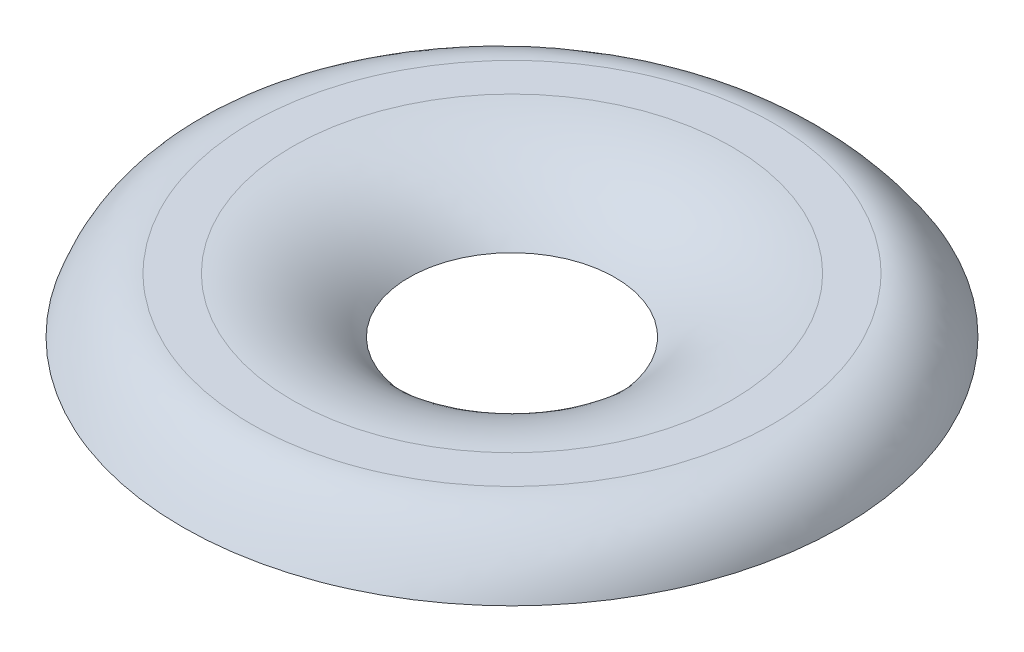
ISO-10303-21;
HEADER;
FILE_DESCRIPTION(('STEP AP214'),'2;1');
FILE_NAME('part.step','',(''),(''),'','','');
FILE_SCHEMA(('AUTOMOTIVE_DESIGN { 1 0 10303 214 1 1 1 1 }'));
ENDSEC;
DATA;
#1=APPLICATION_CONTEXT('core data for automotive mechanical design processes');
#2=APPLICATION_PROTOCOL_DEFINITION('international standard','automotive_design',2000,#1);
#3=PRODUCT_CONTEXT('',#1,'mechanical');
#4=PRODUCT('Part','Part','',(#3));
#5=PRODUCT_RELATED_PRODUCT_CATEGORY('part','',(#4));
#6=PRODUCT_DEFINITION_FORMATION('','',#4);
#7=PRODUCT_DEFINITION_CONTEXT('part definition',#1,'design');
#8=PRODUCT_DEFINITION('design','',#6,#7);
#9=PRODUCT_DEFINITION_SHAPE('','',#8);
#10=(LENGTH_UNIT() NAMED_UNIT(*) SI_UNIT(.MILLI.,.METRE.));
#11=(NAMED_UNIT(*) PLANE_ANGLE_UNIT() SI_UNIT($,.RADIAN.));
#12=(NAMED_UNIT(*) SI_UNIT($,.STERADIAN.) SOLID_ANGLE_UNIT());
#13=UNCERTAINTY_MEASURE_WITH_UNIT(LENGTH_MEASURE(1.E-05),#10,'distance_accuracy_value','');
#14=(GEOMETRIC_REPRESENTATION_CONTEXT(3) GLOBAL_UNCERTAINTY_ASSIGNED_CONTEXT((#13)) GLOBAL_UNIT_ASSIGNED_CONTEXT((#10,
#11,#12)) REPRESENTATION_CONTEXT('',''));
#15=CARTESIAN_POINT('',(0.,0.,0.));
#16=DIRECTION('',(0.,0.,1.));
#17=DIRECTION('',(1.,0.,0.));
#18=AXIS2_PLACEMENT_3D('',#15,#16,#17);
#19=CARTESIAN_POINT('',(-14.1973752245565,0.,-3.45341559516241));
#20=DIRECTION('',(0.,-1.,0.));
#21=DIRECTION('',(1.,0.,0.));
#22=AXIS2_PLACEMENT_3D('',#19,#20,#21);
#23=CYLINDRICAL_SURFACE('',#22,8.);
#24=CARTESIAN_POINT('',(-14.1973752245565,2.00000000000001,-3.45341559516241));
#25=DIRECTION('',(0.,-1.,0.));
#26=DIRECTION('',(1.,0.,0.));
#27=AXIS2_PLACEMENT_3D('',#24,#25,#26);
#28=CIRCLE('',#27,8.);
#29=CARTESIAN_POINT('',(-6.19737522455655,2.00000000000001,-3.45341559516241));
#30=VERTEX_POINT('',#29);
#31=EDGE_CURVE('E13',#30,#30,#28,.T.);
#32=ORIENTED_EDGE('',*,*,#31,.T.);
#33=EDGE_LOOP('',(#32));
#34=FACE_BOUND('',#33,.T.);
#35=CARTESIAN_POINT('',(-14.1973752245565,1.14185849984802,-3.45341559516241));
#36=DIRECTION('',(0.,-1.,0.));
#37=DIRECTION('',(1.,0.,0.));
#38=AXIS2_PLACEMENT_3D('',#35,#36,#37);
#39=CIRCLE('',#38,8.);
#40=CARTESIAN_POINT('',(-6.19737522455655,1.14185849984803,-3.45341559516241));
#41=VERTEX_POINT('',#40);
#42=EDGE_CURVE('E105',#41,#41,#39,.T.);
#43=ORIENTED_EDGE('',*,*,#42,.F.);
#44=EDGE_LOOP('',(#43));
#45=FACE_BOUND('',#44,.T.);
#46=ADVANCED_FACE('F98',(#34,#45),#23,.T.);
#47=CARTESIAN_POINT('',(-14.1973752245565,-3.51562499999999,-3.45341559516241));
#48=DIRECTION('',(0.,-1.,0.));
#49=DIRECTION('',(1.,0.,0.));
#50=AXIS2_PLACEMENT_3D('',#47,#48,#49);
#51=TOROIDAL_SURFACE('',#50,8.,5.515625);
#52=CARTESIAN_POINT('',(-14.1973752245565,0.,-3.45341559516241));
#53=DIRECTION('',(0.,-1.,0.));
#54=DIRECTION('',(1.,0.,0.));
#55=AXIS2_PLACEMENT_3D('',#52,#53,#54);
#56=CIRCLE('',#55,3.75);
#57=CARTESIAN_POINT('',(-10.4473752245565,0.,-3.45341559516241));
#58=VERTEX_POINT('',#57);
#59=EDGE_CURVE('E109',#58,#58,#56,.T.);
#60=ORIENTED_EDGE('',*,*,#59,.T.);
#61=EDGE_LOOP('',(#60));
#62=FACE_BOUND('',#61,.T.);
#63=ORIENTED_EDGE('',*,*,#31,.F.);
#64=EDGE_LOOP('',(#63));
#65=FACE_BOUND('',#64,.T.);
#66=ADVANCED_FACE('F100',(#62,#65),#51,.T.);
#67=CARTESIAN_POINT('',(-14.1973752245565,-6.87307543904334,-3.45341559516241));
#68=DIRECTION('',(0.,-1.,0.));
#69=DIRECTION('',(1.,0.,0.));
#70=AXIS2_PLACEMENT_3D('',#67,#68,#69);
#71=DEGENERATE_TOROIDAL_SURFACE('',#70,7.87500000635432,8.01590862243352,.T.);
#72=ORIENTED_EDGE('',*,*,#59,.F.);
#73=EDGE_LOOP('',(#72));
#74=FACE_BOUND('',#73,.T.);
#75=ORIENTED_EDGE('',*,*,#42,.T.);
#76=EDGE_LOOP('',(#75));
#77=FACE_BOUND('',#76,.T.);
#78=ADVANCED_FACE('F118',(#74,#77),#71,.F.);
#79=CLOSED_SHELL('',(#46,#66,#78));
#80=MANIFOLD_SOLID_BREP('B2',#79);
#81=CARTESIAN_POINT('',(-14.1973752245565,-8.,-3.45341559516241));
#82=DIRECTION('',(0.,1.,0.));
#83=DIRECTION('',(0.,0.,1.));
#84=AXIS2_PLACEMENT_3D('',#81,#82,#83);
#85=CYLINDRICAL_SURFACE('',#84,8.);
#86=CARTESIAN_POINT('',(-14.1973752245565,2.,-3.45341559516241));
#87=DIRECTION('',(0.,1.,0.));
#88=DIRECTION('',(0.,0.,1.));
#89=AXIS2_PLACEMENT_3D('',#86,#87,#88);
#90=CIRCLE('',#89,8.);
#91=CARTESIAN_POINT('',(-14.1973752245565,2.,4.54658440483759));
#92=VERTEX_POINT('',#91);
#93=EDGE_CURVE('E153',#92,#92,#90,.T.);
#94=ORIENTED_EDGE('',*,*,#93,.T.);
#95=EDGE_LOOP('',(#94));
#96=FACE_BOUND('',#95,.T.);
#97=CARTESIAN_POINT('',(-14.1973752245565,1.14185849984802,-3.45341559516241));
#98=DIRECTION('',(0.,-1.,0.));
#99=DIRECTION('',(1.,0.,0.));
#100=AXIS2_PLACEMENT_3D('',#97,#98,#99);
#101=CIRCLE('',#100,8.);
#102=CARTESIAN_POINT('',(-6.19737522455655,1.14185849984803,-3.45341559516241));
#103=VERTEX_POINT('',#102);
#104=EDGE_CURVE('E159',#103,#103,#101,.F.);
#105=ORIENTED_EDGE('',*,*,#104,.F.);
#106=EDGE_LOOP('',(#105));
#107=FACE_BOUND('',#106,.T.);
#108=ADVANCED_FACE('F144',(#96,#107),#85,.F.);
#109=CARTESIAN_POINT('',(-14.1973752245565,2.,-3.45341559516241));
#110=DIRECTION('',(0.,1.,0.));
#111=DIRECTION('',(0.,0.,1.));
#112=AXIS2_PLACEMENT_3D('',#109,#110,#111);
#113=PLANE('',#112);
#114=ORIENTED_EDGE('',*,*,#93,.F.);
#115=EDGE_LOOP('',(#114));
#116=FACE_BOUND('',#115,.T.);
#117=CARTESIAN_POINT('',(-14.1973752245565,2.,-3.45341559516241));
#118=DIRECTION('',(0.,1.,0.));
#119=DIRECTION('',(0.,0.,1.));
#120=AXIS2_PLACEMENT_3D('',#117,#118,#119);
#121=CIRCLE('',#120,9.5);
#122=CARTESIAN_POINT('',(-4.69737522455654,2.,-3.45341559516241));
#123=VERTEX_POINT('',#122);
#124=EDGE_CURVE('E97',#123,#123,#121,.T.);
#125=ORIENTED_EDGE('',*,*,#124,.T.);
#126=EDGE_LOOP('',(#125));
#127=FACE_BOUND('',#126,.T.);
#128=ADVANCED_FACE('F146',(#116,#127),#113,.T.);
#129=CARTESIAN_POINT('',(-2.19737522455654,0.,-3.4534155951624));
#130=CARTESIAN_POINT('',(-2.46036452677313,1.16884134318481,-3.45341559516241));
#131=CARTESIAN_POINT('',(-3.49931284779211,2.,-3.45341559516241));
#132=CARTESIAN_POINT('',(-4.69737522455654,2.,-3.45341559516241));
#133=CARTESIAN_POINT('',(-2.19737522455654,0.,-5.02421190942247));
#134=CARTESIAN_POINT('',(-2.46036452677313,1.16884134318481,-4.9151288320433));
#135=CARTESIAN_POINT('',(-3.49931284779211,2.,-4.80604575466413));
#136=CARTESIAN_POINT('',(-4.69737522455654,2.,-4.69696267728496));
#137=CARTESIAN_POINT('',(-2.82146113331438,0.,-8.16531598386542));
#138=CARTESIAN_POINT('',(-3.0767543117086,1.16884134318481,-7.8380737730917));
#139=CARTESIAN_POINT('',(-4.05950907023007,2.,-7.51083156231799));
#140=CARTESIAN_POINT('',(-5.1914332560129,2.00000000000001,-7.18358935154427));
#141=CARTESIAN_POINT('',(-5.49105051666778,0.,-12.1599369415598));
#142=CARTESIAN_POINT('',(-5.69464727942521,1.16884134318481,-11.5553212455501));
#143=CARTESIAN_POINT('',(-6.44384022727807,2.,-10.9507055495403));
#144=CARTESIAN_POINT('',(-7.30491024557696,1.99999999999999,-10.3460898535305));
#145=CARTESIAN_POINT('',(-9.48539712807634,0.,-14.8289669611996));
#146=CARTESIAN_POINT('',(-9.59873690431086,1.16884134318481,-14.0390009951812));
#147=CARTESIAN_POINT('',(-10.0030613125963,2.00000000000001,-13.2490350291628));
#148=CARTESIAN_POINT('',(-10.4670534917862,2.00000000000001,-12.4590690631444));
#149=CARTESIAN_POINT('',(-14.1973752245564,0.,-15.7662638223456));
#150=CARTESIAN_POINT('',(-14.1973752245565,1.16884134318481,-14.911202410547));
#151=CARTESIAN_POINT('',(-14.1973752245565,2.,-14.0561409987485));
#152=CARTESIAN_POINT('',(-14.1973752245565,2.,-13.2010795869499));
#153=CARTESIAN_POINT('',(-18.9093533210368,0.,-14.8289669611996));
#154=CARTESIAN_POINT('',(-18.7960135448023,1.16884134318481,-14.0390009951812));
#155=CARTESIAN_POINT('',(-18.3916891365169,2.00000000000001,-13.2490350291628));
#156=CARTESIAN_POINT('',(-17.9276969573269,2.,-12.4590690631444));
#157=CARTESIAN_POINT('',(-22.9036999324452,0.,-12.1599369415598));
#158=CARTESIAN_POINT('',(-22.7001031696878,1.16884134318481,-11.55532124555));
#159=CARTESIAN_POINT('',(-21.9509102218349,2.,-10.9507055495402));
#160=CARTESIAN_POINT('',(-21.0898402035361,2.,-10.3460898535305));
#161=CARTESIAN_POINT('',(-25.5732893157988,0.,-8.1653159838655));
#162=CARTESIAN_POINT('',(-25.3179961374046,1.16884134318481,-7.83807377309176));
#163=CARTESIAN_POINT('',(-24.3352413788831,2.00000000000001,-7.51083156231803));
#164=CARTESIAN_POINT('',(-23.2033171931002,2.,-7.18358935154429));
#165=CARTESIAN_POINT('',(-26.1973752245565,0.,-5.02421190942248));
#166=CARTESIAN_POINT('',(-25.93438592234,1.16884134318481,-4.9151288320433));
#167=CARTESIAN_POINT('',(-24.895437601321,2.00000000000001,-4.80604575466413));
#168=CARTESIAN_POINT('',(-23.6973752245565,2.,-4.69696267728496));
#169=CARTESIAN_POINT('',(-26.1973752245565,0.,-1.88261928090234));
#170=CARTESIAN_POINT('',(-25.93438592234,1.16884134318481,-1.99170235828151));
#171=CARTESIAN_POINT('',(-24.895437601321,2.00000000000001,-2.10078543566068));
#172=CARTESIAN_POINT('',(-23.6973752245565,2.,-2.20986851303985));
#173=CARTESIAN_POINT('',(-25.5732893157987,0.,1.2584847935406));
#174=CARTESIAN_POINT('',(-25.3179961374044,1.16884134318481,0.931242582766884));
#175=CARTESIAN_POINT('',(-24.3352413788829,2.00000000000001,0.604000371993169));
#176=CARTESIAN_POINT('',(-23.2033171931001,2.,0.276758161219453));
#177=CARTESIAN_POINT('',(-22.9036999324453,0.,5.25310575123506));
#178=CARTESIAN_POINT('',(-22.7001031696879,1.16884134318481,4.64849005522527));
#179=CARTESIAN_POINT('',(-21.9509102218351,2.,4.04387435921548));
#180=CARTESIAN_POINT('',(-21.0898402035362,2.,3.43925866320569));
#181=CARTESIAN_POINT('',(-18.9093533210368,0.,7.92213577087472));
#182=CARTESIAN_POINT('',(-18.7960135448022,1.16884134318481,7.13216980485632));
#183=CARTESIAN_POINT('',(-18.3916891365168,2.00000000000001,6.34220383883793));
#184=CARTESIAN_POINT('',(-17.9276969573268,2.,5.55223787281953));
#185=CARTESIAN_POINT('',(-14.1973752245565,0.,8.85943263202085));
#186=CARTESIAN_POINT('',(-14.1973752245565,1.16884134318481,8.00437122022228));
#187=CARTESIAN_POINT('',(-14.1973752245566,2.,7.1493098084237));
#188=CARTESIAN_POINT('',(-14.1973752245566,2.,6.29424839662512));
#189=CARTESIAN_POINT('',(-9.48539712807635,0.,7.92213577087476));
#190=CARTESIAN_POINT('',(-9.59873690431086,1.16884134318481,7.13216980485635));
#191=CARTESIAN_POINT('',(-10.0030613125963,2.,6.34220383883794));
#192=CARTESIAN_POINT('',(-10.4670534917862,2.,5.55223787281954));
#193=CARTESIAN_POINT('',(-5.49105051666779,0.,5.25310575123502));
#194=CARTESIAN_POINT('',(-5.69464727942522,1.16884134318481,4.64849005522524));
#195=CARTESIAN_POINT('',(-6.44384022727808,2.,4.04387435921546));
#196=CARTESIAN_POINT('',(-7.30491024557696,2.,3.43925866320569));
#197=CARTESIAN_POINT('',(-2.82146113331438,0.,1.25848479354064));
#198=CARTESIAN_POINT('',(-3.0767543117086,1.16884134318481,0.93124258276691));
#199=CARTESIAN_POINT('',(-4.05950907023008,2.,0.604000371993183));
#200=CARTESIAN_POINT('',(-5.19143325601291,2.,0.276758161219457));
#201=CARTESIAN_POINT('',(-2.19737522455654,0.,-1.88261928090234));
#202=CARTESIAN_POINT('',(-2.46036452677313,1.16884134318481,-1.99170235828151));
#203=CARTESIAN_POINT('',(-3.49931284779211,2.,-2.10078543566068));
#204=CARTESIAN_POINT('',(-4.69737522455654,2.,-2.20986851303985));
#205=CARTESIAN_POINT('',(-2.19737522455654,0.,-3.4534155951624));
#206=CARTESIAN_POINT('',(-2.46036452677313,1.16884134318481,-3.45341559516241));
#207=CARTESIAN_POINT('',(-3.49931284779211,2.,-3.45341559516241));
#208=CARTESIAN_POINT('',(-4.69737522455654,2.,-3.45341559516241));
#209=B_SPLINE_SURFACE_WITH_KNOTS('',3,3,((#129,#130,#131,#132),(#133,#134,#135,#136),(#137,#138,
#139,#140),(#141,#142,#143,#144),(#145,#146,#147,#148),(#149,#150,#151,#152),(#153,#154,#155,
#156),(#157,#158,#159,#160),(#161,#162,#163,#164),(#165,#166,#167,#168),(#169,#170,#171,#172),
(#173,#174,#175,#176),(#177,#178,#179,#180),(#181,#182,#183,#184),(#185,#186,#187,#188),(#189,
#190,#191,#192),(#193,#194,#195,#196),(#197,#198,#199,#200),(#201,#202,#203,#204),(#205,#206,
#207,#208)),.UNSPECIFIED.,.T.,.F.,.F.,(4,1,1,1,1,1,1,1,2,1,1,1,1,1,1,1,4),(4,4),(0.,0.0625,
0.125,0.1875,0.25,0.3125,0.375,0.4375,0.5,0.5625,0.625,0.6875,0.75,0.8125,0.875,0.9375,1.),(0.,
1.),.UNSPECIFIED.);
#210=CARTESIAN_POINT('',(-14.1973752245565,0.,-3.45341559516241));
#211=DIRECTION('',(0.,-1.,0.));
#212=DIRECTION('',(1.,0.,0.));
#213=AXIS2_PLACEMENT_3D('',#210,#211,#212);
#214=CIRCLE('',#213,12.0000000127086);
#215=CARTESIAN_POINT('',(-2.19737522455654,0.,-3.4534155951624));
#216=VERTEX_POINT('',#215);
#217=EDGE_CURVE('E168',#216,#216,#214,.T.);
#218=CARTESIAN_POINT('',(-2.19737522455654,0.,-3.4534155951624));
#219=CARTESIAN_POINT('',(-2.46036452677313,1.16884134318481,-3.45341559516241));
#220=CARTESIAN_POINT('',(-3.49931284779211,2.,-3.45341559516241));
#221=CARTESIAN_POINT('',(-4.69737522455654,2.,-3.45341559516241));
#222=CARTESIAN_POINT('',(-4.69756691453683,2.,-3.45341559516241));
#223=CARTESIAN_POINT('',(-4.69775860451711,2.,-3.45341559516241));
#224=CARTESIAN_POINT('',(-4.69795029449739,2.,-3.45341559516241));
#225=CARTESIAN_POINT('',(-2.19737522455654,0.,-5.02421190942247));
#226=CARTESIAN_POINT('',(-2.46036452677313,1.16884134318481,-4.9151288320433));
#227=CARTESIAN_POINT('',(-3.49931284779211,2.,-4.80604575466413));
#228=CARTESIAN_POINT('',(-4.69737522455654,2.,-4.69696267728496));
#229=CARTESIAN_POINT('',(-4.69756691453683,2.,-4.69694522399258));
#230=CARTESIAN_POINT('',(-4.69775860451711,2.,-4.6969277707002));
#231=CARTESIAN_POINT('',(-4.69795029449739,2.,-4.69691031740782));
#232=CARTESIAN_POINT('',(-2.82146113331438,0.,-8.16531598386542));
#233=CARTESIAN_POINT('',(-3.0767543117086,1.16884134318481,-7.8380737730917));
#234=CARTESIAN_POINT('',(-4.05950907023007,2.,-7.51083156231799));
#235=CARTESIAN_POINT('',(-5.1914332560129,2.00000000000001,-7.18358935154427));
#236=CARTESIAN_POINT('',(-5.19161436388263,2.00000000000001,-7.18353699279055));
#237=CARTESIAN_POINT('',(-5.19179547175235,2.00000000000001,-7.18348463403682));
#238=CARTESIAN_POINT('',(-5.19197657962208,2.00000000000001,-7.1834322752831));
#239=CARTESIAN_POINT('',(-5.49105051666778,0.,-12.1599369415598));
#240=CARTESIAN_POINT('',(-5.69464727942521,1.16884134318481,-11.5553212455501));
#241=CARTESIAN_POINT('',(-6.44384022727807,2.,-10.9507055495403));
#242=CARTESIAN_POINT('',(-7.30491024557696,1.99999999999999,-10.3460898535305));
#243=CARTESIAN_POINT('',(-7.30504801677988,1.99999999999999,-10.3459931150191));
#244=CARTESIAN_POINT('',(-7.30518578798281,1.99999999999999,-10.3458963765078));
#245=CARTESIAN_POINT('',(-7.30532355918574,1.99999999999999,-10.3457996379964));
#246=CARTESIAN_POINT('',(-9.48539712807634,0.,-14.8289669611996));
#247=CARTESIAN_POINT('',(-9.59873690431086,1.16884134318481,-14.0390009951812));
#248=CARTESIAN_POINT('',(-10.0030613125963,2.00000000000001,-13.2490350291628));
#249=CARTESIAN_POINT('',(-10.4670534917862,2.00000000000001,-12.4590690631444));
#250=CARTESIAN_POINT('',(-10.4671277305349,2.00000000000001,-12.4589426685898));
#251=CARTESIAN_POINT('',(-10.4672019692836,2.00000000000001,-12.4588162740352));
#252=CARTESIAN_POINT('',(-10.4672762080322,2.00000000000001,-12.4586898794807));
#253=CARTESIAN_POINT('',(-14.1973752245564,0.,-15.7662638223456));
#254=CARTESIAN_POINT('',(-14.1973752245565,1.16884134318481,-14.911202410547));
#255=CARTESIAN_POINT('',(-14.1973752245565,2.,-14.0561409987485));
#256=CARTESIAN_POINT('',(-14.1973752245565,2.,-13.2010795869499));
#257=CARTESIAN_POINT('',(-14.1973752245565,2.,-13.200942777124));
#258=CARTESIAN_POINT('',(-14.1973752245565,2.,-13.2008059672981));
#259=CARTESIAN_POINT('',(-14.1973752245565,2.,-13.2006691574722));
#260=CARTESIAN_POINT('',(-18.9093533210368,0.,-14.8289669611996));
#261=CARTESIAN_POINT('',(-18.7960135448023,1.16884134318481,-14.0390009951812));
#262=CARTESIAN_POINT('',(-18.3916891365169,2.00000000000001,-13.2490350291628));
#263=CARTESIAN_POINT('',(-17.9276969573269,2.,-12.4590690631444));
#264=CARTESIAN_POINT('',(-17.9276227185782,2.,-12.4589426685898));
#265=CARTESIAN_POINT('',(-17.9275484798296,2.,-12.4588162740353));
#266=CARTESIAN_POINT('',(-17.9274742410809,2.,-12.4586898794807));
#267=CARTESIAN_POINT('',(-22.9036999324452,0.,-12.1599369415598));
#268=CARTESIAN_POINT('',(-22.7001031696878,1.16884134318481,-11.55532124555));
#269=CARTESIAN_POINT('',(-21.9509102218349,2.,-10.9507055495402));
#270=CARTESIAN_POINT('',(-21.0898402035361,2.,-10.3460898535305));
#271=CARTESIAN_POINT('',(-21.0897024323331,2.,-10.3459931150191));
#272=CARTESIAN_POINT('',(-21.0895646611302,2.,-10.3458963765077));
#273=CARTESIAN_POINT('',(-21.0894268899273,2.,-10.3457996379964));
#274=CARTESIAN_POINT('',(-25.5732893157988,0.,-8.1653159838655));
#275=CARTESIAN_POINT('',(-25.3179961374046,1.16884134318481,-7.83807377309176));
#276=CARTESIAN_POINT('',(-24.3352413788831,2.00000000000001,-7.51083156231803));
#277=CARTESIAN_POINT('',(-23.2033171931002,2.,-7.18358935154429));
#278=CARTESIAN_POINT('',(-23.2031360852305,2.,-7.18353699279057));
#279=CARTESIAN_POINT('',(-23.2029549773608,2.,-7.18348463403684));
#280=CARTESIAN_POINT('',(-23.2027738694911,2.,-7.18343227528312));
#281=CARTESIAN_POINT('',(-26.1973752245565,0.,-5.02421190942248));
#282=CARTESIAN_POINT('',(-25.93438592234,1.16884134318481,-4.9151288320433));
#283=CARTESIAN_POINT('',(-24.895437601321,2.00000000000001,-4.80604575466413));
#284=CARTESIAN_POINT('',(-23.6973752245565,2.,-4.69696267728496));
#285=CARTESIAN_POINT('',(-23.6971835345763,2.,-4.69694522399258));
#286=CARTESIAN_POINT('',(-23.696991844596,2.,-4.6969277707002));
#287=CARTESIAN_POINT('',(-23.6968001546157,2.,-4.69691031740782));
#288=CARTESIAN_POINT('',(-26.1973752245565,0.,-1.88261928090234));
#289=CARTESIAN_POINT('',(-25.93438592234,1.16884134318481,-1.99170235828151));
#290=CARTESIAN_POINT('',(-24.895437601321,2.00000000000001,-2.10078543566068));
#291=CARTESIAN_POINT('',(-23.6973752245565,2.,-2.20986851303985));
#292=CARTESIAN_POINT('',(-23.6971835345763,2.,-2.20988596633223));
#293=CARTESIAN_POINT('',(-23.696991844596,2.,-2.20990341962461));
#294=CARTESIAN_POINT('',(-23.6968001546157,2.,-2.20992087291699));
#295=CARTESIAN_POINT('',(-25.5732893157987,0.,1.2584847935406));
#296=CARTESIAN_POINT('',(-25.3179961374044,1.16884134318481,0.931242582766884));
#297=CARTESIAN_POINT('',(-24.3352413788829,2.00000000000001,0.604000371993169));
#298=CARTESIAN_POINT('',(-23.2033171931001,2.,0.276758161219453));
#299=CARTESIAN_POINT('',(-23.2031360852303,2.,0.276705802465729));
#300=CARTESIAN_POINT('',(-23.2029549773606,2.,0.276653443712005));
#301=CARTESIAN_POINT('',(-23.2027738694909,2.,0.276601084958281));
#302=CARTESIAN_POINT('',(-22.9036999324453,0.,5.25310575123506));
#303=CARTESIAN_POINT('',(-22.7001031696879,1.16884134318481,4.64849005522527));
#304=CARTESIAN_POINT('',(-21.9509102218351,2.,4.04387435921548));
#305=CARTESIAN_POINT('',(-21.0898402035362,2.,3.43925866320569));
#306=CARTESIAN_POINT('',(-21.0897024323333,2.,3.43916192469433));
#307=CARTESIAN_POINT('',(-21.0895646611304,2.,3.43906518618297));
#308=CARTESIAN_POINT('',(-21.0894268899275,2.,3.43896844767161));
#309=CARTESIAN_POINT('',(-18.9093533210368,0.,7.92213577087472));
#310=CARTESIAN_POINT('',(-18.7960135448022,1.16884134318481,7.13216980485632));
#311=CARTESIAN_POINT('',(-18.3916891365168,2.00000000000001,6.34220383883793));
#312=CARTESIAN_POINT('',(-17.9276969573268,2.,5.55223787281953));
#313=CARTESIAN_POINT('',(-17.9276227185781,2.,5.55211147826497));
#314=CARTESIAN_POINT('',(-17.9275484798294,2.,5.5519850837104));
#315=CARTESIAN_POINT('',(-17.9274742410808,2.,5.55185868915584));
#316=CARTESIAN_POINT('',(-14.1973752245565,0.,8.85943263202085));
#317=CARTESIAN_POINT('',(-14.1973752245565,1.16884134318481,8.00437122022228));
#318=CARTESIAN_POINT('',(-14.1973752245566,2.,7.1493098084237));
#319=CARTESIAN_POINT('',(-14.1973752245566,2.,6.29424839662512));
#320=CARTESIAN_POINT('',(-14.1973752245566,2.,6.29411158679923));
#321=CARTESIAN_POINT('',(-14.1973752245566,2.,6.29397477697334));
#322=CARTESIAN_POINT('',(-14.1973752245566,2.,6.29383796714745));
#323=CARTESIAN_POINT('',(-9.48539712807635,0.,7.92213577087476));
#324=CARTESIAN_POINT('',(-9.59873690431086,1.16884134318481,7.13216980485635));
#325=CARTESIAN_POINT('',(-10.0030613125963,2.,6.34220383883794));
#326=CARTESIAN_POINT('',(-10.4670534917862,2.,5.55223787281954));
#327=CARTESIAN_POINT('',(-10.4671277305349,2.,5.55211147826497));
#328=CARTESIAN_POINT('',(-10.4672019692836,2.,5.55198508371041));
#329=CARTESIAN_POINT('',(-10.4672762080322,2.,5.55185868915585));
#330=CARTESIAN_POINT('',(-5.49105051666779,0.,5.25310575123502));
#331=CARTESIAN_POINT('',(-5.69464727942522,1.16884134318481,4.64849005522524));
#332=CARTESIAN_POINT('',(-6.44384022727808,2.,4.04387435921546));
#333=CARTESIAN_POINT('',(-7.30491024557696,2.,3.43925866320569));
#334=CARTESIAN_POINT('',(-7.30504801677989,2.,3.43916192469433));
#335=CARTESIAN_POINT('',(-7.30518578798282,2.,3.43906518618296));
#336=CARTESIAN_POINT('',(-7.30532355918575,2.,3.4389684476716));
#337=CARTESIAN_POINT('',(-2.82146113331438,0.,1.25848479354064));
#338=CARTESIAN_POINT('',(-3.0767543117086,1.16884134318481,0.93124258276691));
#339=CARTESIAN_POINT('',(-4.05950907023008,2.,0.604000371993183));
#340=CARTESIAN_POINT('',(-5.19143325601291,2.,0.276758161219457));
#341=CARTESIAN_POINT('',(-5.19161436388263,2.,0.276705802465733));
#342=CARTESIAN_POINT('',(-5.19179547175236,2.,0.276653443712009));
#343=CARTESIAN_POINT('',(-5.19197657962208,2.,0.276601084958285));
#344=CARTESIAN_POINT('',(-2.19737522455654,0.,-1.88261928090234));
#345=CARTESIAN_POINT('',(-2.46036452677313,1.16884134318481,-1.99170235828151));
#346=CARTESIAN_POINT('',(-3.49931284779211,2.,-2.10078543566068));
#347=CARTESIAN_POINT('',(-4.69737522455654,2.,-2.20986851303985));
#348=CARTESIAN_POINT('',(-4.69756691453683,2.,-2.20988596633223));
#349=CARTESIAN_POINT('',(-4.69775860451711,2.,-2.20990341962461));
#350=CARTESIAN_POINT('',(-4.69795029449739,2.,-2.20992087291699));
#351=CARTESIAN_POINT('',(-2.19737522455654,0.,-3.4534155951624));
#352=CARTESIAN_POINT('',(-2.46036452677313,1.16884134318481,-3.45341559516241));
#353=CARTESIAN_POINT('',(-3.49931284779211,2.,-3.45341559516241));
#354=CARTESIAN_POINT('',(-4.69737522455654,2.,-3.45341559516241));
#355=CARTESIAN_POINT('',(-4.69756691453683,2.,-3.45341559516241));
#356=CARTESIAN_POINT('',(-4.69775860451711,2.,-3.45341559516241));
#357=CARTESIAN_POINT('',(-4.69795029449739,2.,-3.45341559516241));
#358=B_SPLINE_SURFACE_WITH_KNOTS('',3,3,((#218,#219,#220,#221,#222,#223,#224),(#225,#226,#227,
#228,#229,#230,#231),(#232,#233,#234,#235,#236,#237,#238),(#239,#240,#241,#242,#243,#244,#245),
(#246,#247,#248,#249,#250,#251,#252),(#253,#254,#255,#256,#257,#258,#259),(#260,#261,#262,#263,
#264,#265,#266),(#267,#268,#269,#270,#271,#272,#273),(#274,#275,#276,#277,#278,#279,#280),(#281,
#282,#283,#284,#285,#286,#287),(#288,#289,#290,#291,#292,#293,#294),(#295,#296,#297,#298,#299,
#300,#301),(#302,#303,#304,#305,#306,#307,#308),(#309,#310,#311,#312,#313,#314,#315),(#316,#317,
#318,#319,#320,#321,#322),(#323,#324,#325,#326,#327,#328,#329),(#330,#331,#332,#333,#334,#335,
#336),(#337,#338,#339,#340,#341,#342,#343),(#344,#345,#346,#347,#348,#349,#350),(#351,#352,#353,
#354,#355,#356,#357)),.UNSPECIFIED.,.T.,.F.,.F.,(4,1,1,1,1,1,1,1,2,1,1,1,1,1,1,1,4),(4,3,4),(0.,
0.0625,0.125,0.1875,0.25,0.3125,0.375,0.4375,0.5,0.5625,0.625,0.6875,0.75,0.8125,0.875,0.9375,
1.),(0.,1.,1.00016),.UNSPECIFIED.);
#359=CARTESIAN_POINT('',(-2.19737522455654,0.,-3.4534155951624));
#360=CARTESIAN_POINT('',(-2.19942771139951,0.00912218118452747,-3.4534155951624));
#361=CARTESIAN_POINT('',(-2.20152959677417,0.0182332493900005,-3.4534155951624));
#362=CARTESIAN_POINT('',(-2.20582770014776,0.0364136458860446,-3.4534155951624));
#363=CARTESIAN_POINT('',(-2.20802371869977,0.0454830213296271,-3.4534155951624));
#364=CARTESIAN_POINT('',(-2.21250949882119,0.0635795607836494,-3.4534155951624));
#365=CARTESIAN_POINT('',(-2.21479906681201,0.0726067727773328,-3.4534155951624));
#366=CARTESIAN_POINT('',(-2.21947135044594,0.0906185139485831,-3.4534155951624));
#367=CARTESIAN_POINT('',(-2.2218538782989,0.0996030918388476,-3.4534155951624));
#368=CARTESIAN_POINT('',(-2.22671148794749,0.117529093512183,-3.4534155951624));
#369=CARTESIAN_POINT('',(-2.22918638764502,0.126470566639865,-3.4534155951624));
#370=CARTESIAN_POINT('',(-2.23422814695037,0.144309887596403,-3.4534155951624));
#371=CARTESIAN_POINT('',(-2.23679483005801,0.153207785307396,-3.4534155951624));
#372=CARTESIAN_POINT('',(-2.24201956235887,0.170959484332291,-3.4534155951624));
#373=CARTESIAN_POINT('',(-2.24467744055335,0.179813335974651,-3.4534155951624));
#374=CARTESIAN_POINT('',(-2.25008396927089,0.197476471854954,-3.4534155951624));
#375=CARTESIAN_POINT('',(-2.2528324541992,0.20628580677964,-3.4534155951624));
#376=CARTESIAN_POINT('',(-2.25841960273399,0.223859438304794,-3.4534155951624));
#377=CARTESIAN_POINT('',(-2.26125810605119,0.232623785865423,-3.4534155951624));
#378=CARTESIAN_POINT('',(-2.26702469781086,0.25010697182706,-3.4534155951624));
#379=CARTESIAN_POINT('',(-2.26995263117012,0.258825861379926,-3.4534155951624));
#380=CARTESIAN_POINT('',(-2.27589748956203,0.27621766057184,-3.4534155951624));
#381=CARTESIAN_POINT('',(-2.27891426461747,0.284890621475849,-3.4534155951624));
#382=CARTESIAN_POINT('',(-2.28503621305075,0.302190092693925,-3.4534155951624));
#383=CARTESIAN_POINT('',(-2.2881412414568,0.310816654310553,-3.4534155951624));
#384=CARTESIAN_POINT('',(-2.2944391033419,0.3280228563527,-3.4534155951624));
#385=CARTESIAN_POINT('',(-2.29763179675362,0.336602548045936,-3.4534155951624));
#386=CARTESIAN_POINT('',(-2.3041043955025,0.353714539712016,-3.4534155951624));
#387=CARTESIAN_POINT('',(-2.30738416557563,0.362246890848307,-3.45341559516241));
#388=CARTESIAN_POINT('',(-2.31403032460178,0.379263730940069,-3.45341559516241));
#389=CARTESIAN_POINT('',(-2.31739658299284,0.387748270888254,-3.4534155951624));
#390=CARTESIAN_POINT('',(-2.32421512571135,0.404669018209258,-3.4534155951624));
#391=CARTESIAN_POINT('',(-2.32766728407775,0.413105276340508,-3.45341559516241));
#392=CARTESIAN_POINT('',(-2.33465703390536,0.42992898969605,-3.45341559516241));
#393=CARTESIAN_POINT('',(-2.33819450390548,0.438316495383799,-3.4534155951624));
#394=CARTESIAN_POINT('',(-2.3453542842606,0.455042233580838,-3.4534155951624));
#395=CARTESIAN_POINT('',(-2.3489764775539,0.463380516200711,-3.45341559516241));
#396=CARTESIAN_POINT('',(-2.35630511185669,0.480007338047791,-3.45341559516241));
#397=CARTESIAN_POINT('',(-2.36001144010377,0.488295926977531,-3.4534155951624));
#398=CARTESIAN_POINT('',(-2.36750775177614,0.504822891284704,-3.4534155951624));
#399=CARTESIAN_POINT('',(-2.37129762663883,0.5130613159041,-3.45341559516241));
#400=CARTESIAN_POINT('',(-2.37896043910452,0.529487481482845,-3.45341559516241));
#401=CARTESIAN_POINT('',(-2.38283327224594,0.537675271173648,-3.4534155951624));
#402=CARTESIAN_POINT('',(-2.39066140893053,0.553999696836798,-3.45341559516241));
#403=CARTESIAN_POINT('',(-2.39461661201517,0.562136380982646,-3.45341559516241));
#404=CARTESIAN_POINT('',(-2.40260889634611,0.578358125544302,-3.45341559516241));
#405=CARTESIAN_POINT('',(-2.40664588103989,0.586443233530638,-3.45341559516241));
#406=CARTESIAN_POINT('',(-2.41480113644654,0.602561355806093,-3.4534155951624));
#407=CARTESIAN_POINT('',(-2.41891931441689,0.610594417020083,-3.45341559516241));
#408=CARTESIAN_POINT('',(-2.42723636433053,0.62660797582574,-3.45341559516241));
#409=CARTESIAN_POINT('',(-2.4314351472464,0.634588519656185,-3.4534155951624));
#410=CARTESIAN_POINT('',(-2.43991281510025,0.65049657380948,-3.4534155951624));
#411=CARTESIAN_POINT('',(-2.44419161463223,0.658424129646738,-3.45341559516241));
#412=CARTESIAN_POINT('',(-2.45282872386148,0.674225737966056,-3.45341559516241));
#413=CARTESIAN_POINT('',(-2.45718695168177,0.682099835201951,-3.45341559516241));
#414=CARTESIAN_POINT('',(-2.4659823257236,0.697794056506549,-3.45341559516241));
#415=CARTESIAN_POINT('',(-2.4704193935061,0.705614224534288,-3.4534155951624));
#416=CARTESIAN_POINT('',(-2.47937185579968,0.721200117644215,-3.4534155951624));
#417=CARTESIAN_POINT('',(-2.48388717522003,0.7289658858583,-3.45341559516241));
#418=CARTESIAN_POINT('',(-2.49299554920653,0.74444250959432,-3.45341559516241));
#419=CARTESIAN_POINT('',(-2.49758853194211,0.752153407390461,-3.4534155951624));
#420=CARTESIAN_POINT('',(-2.50685164106473,0.76751982057397,-3.4534155951624));
#421=CARTESIAN_POINT('',(-2.51152169879472,0.775175377348999,-3.45341559516241));
#422=CARTESIAN_POINT('',(-2.52093836649865,0.790430638801952,-3.45341559516241));
#423=CARTESIAN_POINT('',(-2.52568491090404,0.798030383953735,-3.4534155951624));
#424=CARTESIAN_POINT('',(-2.53525396063651,0.813173552498568,-3.4534155951624));
#425=CARTESIAN_POINT('',(-2.54007640340016,0.820717015425922,-3.45341559516241));
#426=CARTESIAN_POINT('',(-2.54979665861041,0.835747149885474,-3.45341559516241));
#427=CARTESIAN_POINT('',(-2.55469441141699,0.843233859988074,-3.4534155951624));
#428=CARTESIAN_POINT('',(-2.56456469555628,0.858150019185515,-3.4534155951624));
#429=CARTESIAN_POINT('',(-2.56953717009236,0.865579505863815,-3.45341559516241));
#430=CARTESIAN_POINT('',(-2.57955630661396,0.880380748622569,-3.45341559516241));
#431=CARTESIAN_POINT('',(-2.58460291456799,0.887752541277715,-3.4534155951624));
#432=CARTESIAN_POINT('',(-2.59476972692718,0.902437926421387,-3.4534155951624));
#433=CARTESIAN_POINT('',(-2.59988987998949,0.909751554455129,-3.45341559516241));
#434=CARTESIAN_POINT('',(-2.61020319164355,0.924320140807436,-3.45341559516241));
#435=CARTESIAN_POINT('',(-2.61539630150636,0.931575133622049,-3.4534155951624));
#436=CARTESIAN_POINT('',(-2.62585493591456,0.946025980006745,-3.4534155951624));
#437=CARTESIAN_POINT('',(-2.63112041427199,0.953221867004946,-3.45341559516241));
#438=CARTESIAN_POINT('',(-2.64172319489555,0.967554032245754,-3.45341559516241));
#439=CARTESIAN_POINT('',(-2.64706045344363,0.974690342830617,-3.45341559516241));
#440=CARTESIAN_POINT('',(-2.65780620374575,0.988902885751162,-3.45341559516241));
#441=CARTESIAN_POINT('',(-2.66321465418236,0.995979149326039,-3.45341559516241));
#442=CARTESIAN_POINT('',(-2.67410219762818,1.01007112874978,-3.45341559516241));
#443=CARTESIAN_POINT('',(-2.6795812516531,1.01708687471822,-3.4534155951624));
#444=CARTESIAN_POINT('',(-2.69060941170968,1.03105734946838,-3.45341559516241));
#445=CARTESIAN_POINT('',(-2.69615848102456,1.03801210723406,-3.45341559516241));
#446=CARTESIAN_POINT('',(-2.70732608116086,1.05186013613356,-3.45341559516241));
#447=CARTESIAN_POINT('',(-2.71294457746919,1.0587534351002,-3.45341559516241));
#448=CARTESIAN_POINT('',(-2.72425044115607,1.07247807697161,-3.45341559516241));
#449=CARTESIAN_POINT('',(-2.72993777616318,1.07930944654288,-3.45341559516241));
#450=CARTESIAN_POINT('',(-2.74138072687333,1.09290976020835,-3.45341559516241));
#451=CARTESIAN_POINT('',(-2.74713631228637,1.09967872978783,-3.45341559516241));
#452=CARTESIAN_POINT('',(-2.75871517349435,1.113153774069,-3.45341559516241));
#453=CARTESIAN_POINT('',(-2.76453842102227,1.1198598730601,-3.45341559516241));
#454=CARTESIAN_POINT('',(-2.77625201620443,1.13320870677809,-3.45341559516241));
#455=CARTESIAN_POINT('',(-2.78214233755793,1.13985146458394,-3.45341559516241));
#456=CARTESIAN_POINT('',(-2.79398949019241,1.15307314655926,-3.4534155951624));
#457=CARTESIAN_POINT('',(-2.79994629708396,1.15965209258269,-3.45341559516241));
#458=CARTESIAN_POINT('',(-2.81192583065066,1.17274568163519,-3.45341559516241));
#459=CARTESIAN_POINT('',(-2.81794853479444,1.17926034527863,-3.45341559516241));
#460=CARTESIAN_POINT('',(-2.83005927277497,1.19222490022745,-3.45341559516241));
#461=CARTESIAN_POINT('',(-2.83614728588684,1.19867481089287,-3.45341559516241));
#462=CARTESIAN_POINT('',(-2.84838805176451,1.21150939055637,-3.45341559516241));
#463=CARTESIAN_POINT('',(-2.854540785562,1.21789407764522,-3.45341559516241));
#464=CARTESIAN_POINT('',(-2.8669104028218,1.23059774084095,-3.45341559516241));
#465=CARTESIAN_POINT('',(-2.87312726902404,1.23691673375409,-3.45341559516241));
#466=CARTESIAN_POINT('',(-2.88562456115257,1.24948853929872,-3.45341559516241));
#467=CARTESIAN_POINT('',(-2.8919049714803,1.25574136743635,-3.45341559516241));
#468=CARTESIAN_POINT('',(-2.90452876196576,1.26818037414564,-3.45341559516241));
#469=CARTESIAN_POINT('',(-2.91087212814125,1.27436656690726,-3.45341559516241));
#470=CARTESIAN_POINT('',(-2.92362124047341,1.28667183359596,-3.45341559516241));
#471=CARTESIAN_POINT('',(-2.93002697422044,1.29279092038029,-3.45341559516241));
#472=CARTESIAN_POINT('',(-2.94290023189058,1.30496150586216,-3.45341559516241));
#473=CARTESIAN_POINT('',(-2.94936774493441,1.31101301606709,-3.45341559516241));
#474=CARTESIAN_POINT('',(-2.96236397143532,1.3230479791548,-3.45341559516241));
#475=CARTESIAN_POINT('',(-2.96889267550262,1.32903144217735,-3.45341559516241));
#476=CARTESIAN_POINT('',(-2.98201069432851,1.34092984168247,-3.45341559516241));
#477=CARTESIAN_POINT('',(-2.98860000114733,1.34684478691867,-3.45341559516241));
#478=CARTESIAN_POINT('',(-3.00183863579386,1.35860568165161,-3.45341559516241));
#479=CARTESIAN_POINT('',(-3.00848795709359,1.36445163849654,-3.45341559516241));
#480=CARTESIAN_POINT('',(-3.02184603105775,1.3760740872665,-3.45341559516241));
#481=CARTESIAN_POINT('',(-3.02855477856908,1.38185058511417,-3.45341559516241));
#482=CARTESIAN_POINT('',(-3.04203111534921,1.39333364672911,-3.45341559516241));
#483=CARTESIAN_POINT('',(-3.04879870080404,1.39904021497241,-3.45341559516241));
#484=CARTESIAN_POINT('',(-3.06239212389978,1.41038294823902,-3.45341559516241));
#485=CARTESIAN_POINT('',(-3.06921795903122,1.41601911626972,-3.45341559516241));
#486=CARTESIAN_POINT('',(-3.08292729194343,1.42722057999333,-3.45341559516241));
#487=CARTESIAN_POINT('',(-3.08981078848572,1.432785877202,-3.45341559516241));
#488=CARTESIAN_POINT('',(-3.10363485471648,1.44384513018661,-3.45341559516241));
#489=CARTESIAN_POINT('',(-3.11057542440495,1.44933908596255,-3.45341559516241));
#490=CARTESIAN_POINT('',(-3.1245130474575,1.46025518701075,-3.45341559516241));
#491=CARTESIAN_POINT('',(-3.1315101020285,1.465677330742,-3.45341559516241));
#492=CARTESIAN_POINT('',(-3.14556010540718,1.47644933865492,-3.45341559516241));
#493=CARTESIAN_POINT('',(-3.15261305659805,1.48179919972818,-3.45341559516241));
#494=CARTESIAN_POINT('',(-3.16677426380827,1.49242617330552,-3.45341559516241));
#495=CARTESIAN_POINT('',(-3.17388252335725,1.49770328110611,-3.45341559516241));
#496=CARTESIAN_POINT('',(-3.18815375790544,1.50818427914602,-3.45341559516241));
#497=CARTESIAN_POINT('',(-3.19531673755166,1.51338816305786,-3.45341559516241));
#498=CARTESIAN_POINT('',(-3.20969682294522,1.52372224435699,-3.45341559516241));
#499=CARTESIAN_POINT('',(-3.21691393442858,1.52885243376253,-3.45341559516241));
#500=CARTESIAN_POINT('',(-3.23140169417585,1.53903865711593,-3.45341559516241));
#501=CARTESIAN_POINT('',(-3.23867234923701,1.54409468139615,-3.45341559516241));
#502=CARTESIAN_POINT('',(-3.25326660684716,1.55413210559729,-3.45341559516241));
#503=CARTESIAN_POINT('',(-3.26059021722746,1.55911349413166,-3.45341559516241));
#504=CARTESIAN_POINT('',(-3.27528979621053,1.56900117797236,-3.45341559516241));
#505=CARTESIAN_POINT('',(-3.28266577365191,1.57390746013876,-3.45341559516241));
#506=CARTESIAN_POINT('',(-3.29746949751867,1.5836444624092,-3.45341559516241));
#507=CARTESIAN_POINT('',(-3.30489725376366,1.58847516758396,-3.45341559516241));
#508=CARTESIAN_POINT('',(-3.31980394602562,1.59806054707261,-3.45341559516241));
#509=CARTESIAN_POINT('',(-3.3272828928172,1.60281520463043,-3.45341559516241));
#510=CARTESIAN_POINT('',(-3.34229137698652,1.61224802012407,-3.45341559516241));
#511=CARTESIAN_POINT('',(-3.34982092606812,1.61692615943801,-3.45341559516241));
#512=CARTESIAN_POINT('',(-3.36493002565757,1.62620546972168,-3.45341559516241));
#513=CARTESIAN_POINT('',(-3.37250958877297,1.63080662016314,-3.45341559516241));
#514=CARTESIAN_POINT('',(-3.38771812729588,1.6399314840201,-3.45341559516241));
#515=CARTESIAN_POINT('',(-3.39534711618913,1.64445517495879,-3.45341559516241));
#516=CARTESIAN_POINT('',(-3.41065391715932,1.65342465117053,-3.45341559516241));
#517=CARTESIAN_POINT('',(-3.41833174357472,1.65787041197444,-3.45341559516241));
#518=CARTESIAN_POINT('',(-3.43373563050644,1.66668355932067,-3.45341559516241));
#519=CARTESIAN_POINT('',(-3.44146170618841,1.67105091935606,-3.4534155951624));
#520=CARTESIAN_POINT('',(-3.4569615025963,1.67970679661463,-3.45341559516241));
#521=CARTESIAN_POINT('',(-3.46473523928936,1.68399528524603,-3.45341559516241));
#522=CARTESIAN_POINT('',(-3.48032976868836,1.69249295119298,-3.45341559516241));
#523=CARTESIAN_POINT('',(-3.48815057813702,1.69670209778314,-3.45341559516241));
#524=CARTESIAN_POINT('',(-3.50383866404235,1.70504061119262,-3.45341559516241));
#525=CARTESIAN_POINT('',(-3.51170595799106,1.70916994510253,-3.45341559516241));
#526=CARTESIAN_POINT('',(-3.52748642391813,1.71734836474685,-3.45341559516241));
#527=CARTESIAN_POINT('',(-3.53539961411118,1.7213974153357,-3.45341559516241));
#528=CARTESIAN_POINT('',(-3.55127128357552,1.72941479998527,-3.45341559516241));
#529=CARTESIAN_POINT('',(-3.559229781757,1.73338309661047,-3.45341559516241));
#530=CARTESIAN_POINT('',(-3.57519147827424,1.7412385050338,-3.45341559516241));
#531=CARTESIAN_POINT('',(-3.58319469618792,1.74512557705097,-3.45341559516241));
#532=CARTESIAN_POINT('',(-3.59924524327367,1.75281806801467,-3.4534155951624));
#533=CARTESIAN_POINT('',(-3.60729259266299,1.75662344477762,-3.45341559516241));
#534=CARTESIAN_POINT('',(-3.62343081383279,1.76415207704638,-3.45341559516241));
#535=CARTESIAN_POINT('',(-3.63152170644071,1.76787528790713,-3.45341559516241));
#536=CARTESIAN_POINT('',(-3.64774642521,1.77523912024371,-3.45341559516241));
#537=CARTESIAN_POINT('',(-3.65588027277895,1.77887969455247,-3.45341559516241));
#538=CARTESIAN_POINT('',(-3.67219031266296,1.78607778571772,-3.45341559516241));
#539=CARTESIAN_POINT('',(-3.68036652693479,1.78963525282293,-3.45341559516241));
#540=CARTESIAN_POINT('',(-3.69676071144849,1.79666666157575,-3.45341559516241));
#541=CARTESIAN_POINT('',(-3.70497870416434,1.80014055082406,-3.45341559516241));
#542=CARTESIAN_POINT('',(-3.72145585682236,1.80700433592143,-3.45341559516241));
#543=CARTESIAN_POINT('',(-3.72971503972261,1.81039417665773,-3.45341559516241));
#544=CARTESIAN_POINT('',(-3.74627398403919,1.81708939685468,-3.45341559516241));
#545=CARTESIAN_POINT('',(-3.75457376886339,1.82039471842211,-3.45341559516241));
#546=CARTESIAN_POINT('',(-3.77121332835228,1.82692043247175,-3.45341559516241));
#547=CARTESIAN_POINT('',(-3.77955312683903,1.83014076421171,-3.45341559516241));
#548=CARTESIAN_POINT('',(-3.79627212501345,1.83649603086524,-3.45341559516241));
#549=CARTESIAN_POINT('',(-3.80465134890036,1.83963090211743,-3.45341559516241));
#550=CARTESIAN_POINT('',(-3.8214486092729,1.84581478012412,-3.45341559516241));
#551=CARTESIAN_POINT('',(-3.82986667029649,1.84886372022654,-3.45341559516241));
#552=CARTESIAN_POINT('',(-3.84674101637906,1.85487526833375,-3.45341559516241));
#553=CARTESIAN_POINT('',(-3.85519732627467,1.85783780662277,-3.45341559516241));
#554=CARTESIAN_POINT('',(-3.87214758157841,1.86367608357595,-3.45341559516241));
#555=CARTESIAN_POINT('',(-3.88064155208015,1.8665517493863,-3.45341559516241));
#556=CARTESIAN_POINT('',(-3.89766654011536,1.87221581392906,-3.45341559516241));
#557=CARTESIAN_POINT('',(-3.90619758295599,1.87500413659389,-3.45341559516241));
#558=CARTESIAN_POINT('',(-3.92329612723207,1.88049304746794,-3.45341559516241));
#559=CARTESIAN_POINT('',(-3.93186365414296,1.88319355631884,-3.45341559516241));
#560=CARTESIAN_POINT('',(-3.94903457816831,1.88850637226406,-3.45341559516241));
#561=CARTESIAN_POINT('',(-3.95763800087934,1.89111859663114,-3.45341559516241));
#562=CARTESIAN_POINT('',(-3.9748801281613,1.89625437638558,-3.45341559516241));
#563=CARTESIAN_POINT('',(-3.98351885840077,1.89877784559749,-3.45341559516241));
#564=CARTESIAN_POINT('',(-4.00083101244555,1.9037356478974,-3.45341559516241));
#565=CARTESIAN_POINT('',(-4.00950446194014,1.90616989128139,-3.45341559516241));
#566=CARTESIAN_POINT('',(-4.02688546625274,1.91094877486125,-3.45341559516241));
#567=CARTESIAN_POINT('',(-4.03559304672739,1.91329332174323,-3.45341559516241));
#568=CARTESIAN_POINT('',(-4.05304172481151,1.91789234533578,-3.45341559516241));
#569=CARTESIAN_POINT('',(-4.06178284798938,1.92014672504036,-3.4534155951624));
#570=CARTESIAN_POINT('',(-4.07929802334738,1.92456494737663,-3.45341559516241));
#571=CARTESIAN_POINT('',(-4.08807210094976,1.92672868922722,-3.45341559516241));
#572=CARTESIAN_POINT('',(-4.10565259708256,1.93096516903656,-3.45341559516241));
#573=CARTESIAN_POINT('',(-4.11445904082879,1.93303780235541,-3.45341559516241));
#574=CARTESIAN_POINT('',(-4.1321036812358,1.93709159836554,-3.4534155951624));
#575=CARTESIAN_POINT('',(-4.14094190284324,1.93907265247382,-3.45341559516241));
#576=CARTESIAN_POINT('',(-4.15864951102229,1.94294282341087,-3.45341559516241));
#577=CARTESIAN_POINT('',(-4.16751892220619,1.94483182762874,-3.45341559516241));
#578=CARTESIAN_POINT('',(-4.18528832165346,1.94851743221729,-3.45341559516241));
#579=CARTESIAN_POINT('',(-4.19418833412696,1.95031391586401,-3.45341559516241));
#580=CARTESIAN_POINT('',(-4.21201834833692,1.95381401282712,-3.45341559516241));
#581=CARTESIAN_POINT('',(-4.22094837381094,1.9555175052211,-3.45341559516241));
#582=CARTESIAN_POINT('',(-4.23883782627624,1.95883115328041,-3.45341559516241));
#583=CARTESIAN_POINT('',(-4.24779727645944,1.96044118373931,-3.45341559516241));
#584=CARTESIAN_POINT('',(-4.26574499067091,1.96356744161503,-3.45341559516241));
#585=CARTESIAN_POINT('',(-4.27473327726963,1.96508353945588,-3.45341559516241));
#586=CARTESIAN_POINT('',(-4.29273807671614,1.96802146586689,-3.45341559516241));
#587=CARTESIAN_POINT('',(-4.30175461143435,1.96944316040612,-3.45341559516241));
#588=CARTESIAN_POINT('',(-4.31981531960279,1.97219181407003,-3.45341559516241));
#589=CARTESIAN_POINT('',(-4.32885951414205,1.97351863462365,-3.45341559516241));
#590=CARTESIAN_POINT('',(-4.34697495451725,1.97607707425684,-3.45341559516241));
#591=CARTESIAN_POINT('',(-4.35604622057664,1.97730855014049,-3.45341559516241));
#592=CARTESIAN_POINT('',(-4.37421521664131,1.97967583445816,-3.45341559516241));
#593=CARTESIAN_POINT('',(-4.3833129659174,1.98081149498725,-3.45341559516241));
#594=CARTESIAN_POINT('',(-4.4015343411521,1.98298668270355,-3.45341559516241));
#595=CARTESIAN_POINT('',(-4.41065798533891,1.98402605719335,-3.45341559516241));
#596=CARTESIAN_POINT('',(-4.42893056322193,1.98600820702137,-3.45341559516241));
#597=CARTESIAN_POINT('',(-4.4380795140109,1.9869508247871,-3.45341559516241));
#598=CARTESIAN_POINT('',(-4.45640211801828,1.9887389954391,-3.45341559516241));
#599=CARTESIAN_POINT('',(-4.46557578709828,1.98958438579622,-3.45341559516241));
#600=CARTESIAN_POINT('',(-4.48394724070363,1.99117763598318,-3.45341559516241));
#601=CARTESIAN_POINT('',(-4.49314503976076,1.99192532824685,-3.45341559516241));
#602=CARTESIAN_POINT('',(-4.51156416643563,1.99332271668047,-3.45341559516241));
#603=CARTESIAN_POINT('',(-4.5207855071538,1.99397224016823,-3.45341559516241));
#604=CARTESIAN_POINT('',(-4.53925113036608,1.99517282555385,-3.45341559516241));
#605=CARTESIAN_POINT('',(-4.54849542442482,1.99572370957596,-3.45341559516241));
#606=CARTESIAN_POINT('',(-4.56700636764457,1.9967265506395,-3.45341559516241));
#607=CARTESIAN_POINT('',(-4.57627302672713,1.99717832453589,-3.45341559516241));
#608=CARTESIAN_POINT('',(-4.59482811340447,1.9979824799233,-3.45341559516241));
#609=CARTESIAN_POINT('',(-4.60411654916757,1.99833467292589,-3.45341559516241));
#610=CARTESIAN_POINT('',(-4.62271460281526,1.99893920157994,-3.45341559516241));
#611=CARTESIAN_POINT('',(-4.63202422700221,1.99919134332846,-3.45341559516241));
#612=CARTESIAN_POINT('',(-4.65066407088645,1.99959530307897,-3.45341559516241));
#613=CARTESIAN_POINT('',(-4.65999429490379,1.99974692169087,-3.45341559516241));
#614=CARTESIAN_POINT('',(-4.67867475320146,1.99994937453183,-3.45341559516241));
#615=CARTESIAN_POINT('',(-4.68802498970367,2.00000000382785,-3.45341559516241));
#616=CARTESIAN_POINT('',(-4.69737522455654,2.,-3.45341559516241));
#617=B_SPLINE_CURVE_WITH_KNOTS('',3,(#359,#360,#361,#362,#363,#364,#365,#366,#367,#368,#369,
#370,#371,#372,#373,#374,#375,#376,#377,#378,#379,#380,#381,#382,#383,#384,#385,#386,#387,#388,
#389,#390,#391,#392,#393,#394,#395,#396,#397,#398,#399,#400,#401,#402,#403,#404,#405,#406,#407,
#408,#409,#410,#411,#412,#413,#414,#415,#416,#417,#418,#419,#420,#421,#422,#423,#424,#425,#426,
#427,#428,#429,#430,#431,#432,#433,#434,#435,#436,#437,#438,#439,#440,#441,#442,#443,#444,#445,
#446,#447,#448,#449,#450,#451,#452,#453,#454,#455,#456,#457,#458,#459,#460,#461,#462,#463,#464,
#465,#466,#467,#468,#469,#470,#471,#472,#473,#474,#475,#476,#477,#478,#479,#480,#481,#482,#483,
#484,#485,#486,#487,#488,#489,#490,#491,#492,#493,#494,#495,#496,#497,#498,#499,#500,#501,#502,
#503,#504,#505,#506,#507,#508,#509,#510,#511,#512,#513,#514,#515,#516,#517,#518,#519,#520,#521,
#522,#523,#524,#525,#526,#527,#528,#529,#530,#531,#532,#533,#534,#535,#536,#537,#538,#539,#540,
#541,#542,#543,#544,#545,#546,#547,#548,#549,#550,#551,#552,#553,#554,#555,#556,#557,#558,#559,
#560,#561,#562,#563,#564,#565,#566,#567,#568,#569,#570,#571,#572,#573,#574,#575,#576,#577,#578,
#579,#580,#581,#582,#583,#584,#585,#586,#587,#588,#589,#590,#591,#592,#593,#594,#595,#596,#597,
#598,#599,#600,#601,#602,#603,#604,#605,#606,#607,#608,#609,#610,#611,#612,#613,#614,#615,#616),
.UNSPECIFIED.,.F.,.F.,(4,2,2,2,2,2,2,2,2,2,2,2,2,2,2,2,2,2,2,2,2,2,2,2,2,2,2,2,2,2,2,2,2,2,2,2,
2,2,2,2,2,2,2,2,2,2,2,2,2,2,2,2,2,2,2,2,2,2,2,2,2,2,2,2,2,2,2,2,2,2,2,2,2,2,2,2,2,2,2,2,2,2,2,2,
2,2,2,2,2,2,2,2,2,2,2,2,2,2,2,2,2,2,2,2,2,2,2,2,2,2,2,2,2,2,2,2,2,2,2,2,2,2,2,2,2,2,2,2,4),(0.,
0.0280505697505911,0.0560443904688771,0.0839829588454114,0.111867746396671,0.13970019958496,
0.167481739952635,0.195213764270478,0.222897644700047,0.250534728969813,0.278126340564869,
0.305673778930012,0.333178319685961,0.360641214858496,0.38806369312025,0.415446960044928,
0.442792198373682,0.470100568293393,0.497373207726566,0.524611232632598,0.551815737320111,
0.578987794770089,0.606128456969524,0.633238755255287,0.660319700667937,0.687372284315184,
0.7143974777447,0.74139623332601,0.768369484641151,0.795318146883839,0.822243117266826,
0.84914527543718,0.87602548389921,0.902884588444742,0.92972341859047,0.956542788022124,
0.983343495045161,1.01012632304173,1.03689204093365,1.06364140365109,1.0903751526068,
1.11709401617555,1.14379871017853,1.17048993837254,1.1971683929437,1.22383475500537,
1.25048969510019,1.27713387370591,1.3037679417448,1.33039254109648,1.3570083051139,
1.38361585914232,1.41021582104095,1.43680880170726,1.46339540560359,1.48997623128594,
1.51655187193471,1.54312291588723,1.56968994717191,1.5962535460438,1.62281428952135,
1.64937275192423,1.67592950541208,1.70248512052386,1.72904016671785,1.75559521291183,
1.78215082802362,1.80870758151146,1.83526604391434,1.86182678739189,1.88839038626378,
1.91495741754847,1.94152846150098,1.96810410214975,1.9946849278321,2.02127153172844,
2.04786451239475,2.07446447429337,2.10107202832179,2.12768779233922,2.1543123916909,
2.18094645972978,2.2075906383355,2.23424557843032,2.26091194049199,2.28759039506315,
2.31428162325716,2.34098631726014,2.36770518082889,2.3944389297846,2.42118829250204,
2.44795401039396,2.47473683839053,2.50153754541357,2.52835691484522,2.55519574499095,
2.58205484953648,2.60893505799851,2.63583721616887,2.66276218655185,2.68971084879454,
2.71668410010968,2.74368285569099,2.77070804912051,2.79776063276775,2.8248415781804,
2.85195187646617,2.8790925386656,2.90626459611558,2.93346910080309,2.96070712570913,
2.9879797651423,3.01528813506201,3.04263337339077,3.07001664031544,3.0974391185772,
3.12490201374973,3.15240655450568,3.17995399287082,3.20754560446588,3.23518268873565,
3.26286656916522,3.29059859348306,3.31838013385073,3.34621258703902,3.37409737459028,
3.40203594296681,3.4300297636851,3.45808033343569),.UNSPECIFIED.);
#618=EDGE_CURVE('BSEAM189',#216,#123,#617,.T.);
#619=ORIENTED_EDGE('',*,*,#217,.F.);
#620=ORIENTED_EDGE('',*,*,#124,.F.);
#621=ORIENTED_EDGE('',*,*,#618,.T.);
#622=ORIENTED_EDGE('',*,*,#618,.F.);
#623=EDGE_LOOP('',(#619,#621,#620,#622));
#624=FACE_BOUND('',#623,.T.);
#625=ADVANCED_FACE('F189',(#624),#358,.T.);
#626=CARTESIAN_POINT('',(-14.1973752245565,-6.87307543904334,-3.45341559516241));
#627=DIRECTION('',(0.,-1.,0.));
#628=DIRECTION('',(1.,0.,0.));
#629=AXIS2_PLACEMENT_3D('',#626,#627,#628);
#630=DEGENERATE_TOROIDAL_SURFACE('',#629,7.87500000635432,8.01590862243352,.T.);
#631=ORIENTED_EDGE('',*,*,#217,.T.);
#632=EDGE_LOOP('',(#631));
#633=FACE_BOUND('',#632,.T.);
#634=ORIENTED_EDGE('',*,*,#104,.T.);
#635=EDGE_LOOP('',(#634));
#636=FACE_BOUND('',#635,.T.);
#637=ADVANCED_FACE('F200',(#633,#636),#630,.F.);
#638=CLOSED_SHELL('',(#108,#128,#625,#637));
#639=MANIFOLD_SOLID_BREP('B8',#638);
#640=ADVANCED_BREP_SHAPE_REPRESENTATION('',(#18,#80,#639),#14);
#641=SHAPE_DEFINITION_REPRESENTATION(#9,#640);
ENDSEC;
END-ISO-10303-21;
